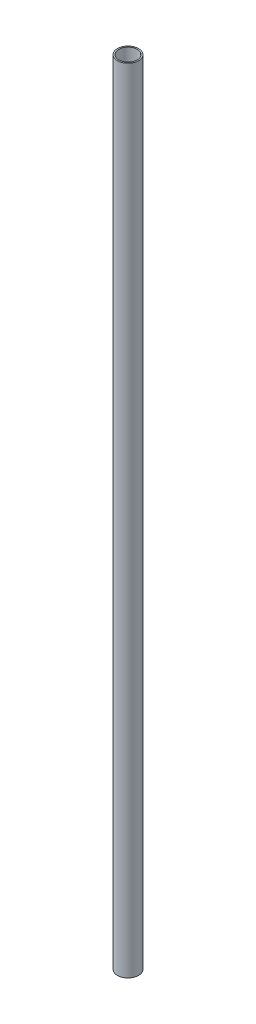
ISO-10303-21;
HEADER;
FILE_DESCRIPTION(('STEP AP214'),'2;1');
FILE_NAME('part.step','',(''),(''),'','','');
FILE_SCHEMA(('AUTOMOTIVE_DESIGN { 1 0 10303 214 1 1 1 1 }'));
ENDSEC;
DATA;
#1=APPLICATION_CONTEXT('core data for automotive mechanical design processes');
#2=APPLICATION_PROTOCOL_DEFINITION('international standard','automotive_design',2000,#1);
#3=PRODUCT_CONTEXT('',#1,'mechanical');
#4=PRODUCT('Part','Part','',(#3));
#5=PRODUCT_RELATED_PRODUCT_CATEGORY('part','',(#4));
#6=PRODUCT_DEFINITION_FORMATION('','',#4);
#7=PRODUCT_DEFINITION_CONTEXT('part definition',#1,'design');
#8=PRODUCT_DEFINITION('design','',#6,#7);
#9=PRODUCT_DEFINITION_SHAPE('','',#8);
#10=(LENGTH_UNIT() NAMED_UNIT(*) SI_UNIT(.MILLI.,.METRE.));
#11=(NAMED_UNIT(*) PLANE_ANGLE_UNIT() SI_UNIT($,.RADIAN.));
#12=(NAMED_UNIT(*) SI_UNIT($,.STERADIAN.) SOLID_ANGLE_UNIT());
#13=UNCERTAINTY_MEASURE_WITH_UNIT(LENGTH_MEASURE(1.E-05),#10,'distance_accuracy_value','');
#14=(GEOMETRIC_REPRESENTATION_CONTEXT(3) GLOBAL_UNCERTAINTY_ASSIGNED_CONTEXT((#13)) GLOBAL_UNIT_ASSIGNED_CONTEXT((#10,
#11,#12)) REPRESENTATION_CONTEXT('',''));
#15=CARTESIAN_POINT('',(0.,0.,0.));
#16=DIRECTION('',(0.,0.,1.));
#17=DIRECTION('',(1.,0.,0.));
#18=AXIS2_PLACEMENT_3D('',#15,#16,#17);
#19=CARTESIAN_POINT('',(0.,300.,0.));
#20=DIRECTION('',(0.,1.,0.));
#21=DIRECTION('',(0.,0.,1.));
#22=AXIS2_PLACEMENT_3D('',#19,#20,#21);
#23=PLANE('',#22);
#24=CARTESIAN_POINT('',(0.,300.,0.));
#25=DIRECTION('',(0.,1.,0.));
#26=DIRECTION('',(0.,0.,1.));
#27=AXIS2_PLACEMENT_3D('',#24,#25,#26);
#28=CIRCLE('',#27,4.);
#29=CARTESIAN_POINT('',(0.,300.,4.));
#30=VERTEX_POINT('',#29);
#31=EDGE_CURVE('E10',#30,#30,#28,.T.);
#32=ORIENTED_EDGE('',*,*,#31,.T.);
#33=EDGE_LOOP('',(#32));
#34=FACE_BOUND('',#33,.T.);
#35=CARTESIAN_POINT('',(0.,300.,0.));
#36=DIRECTION('',(0.,1.,0.));
#37=DIRECTION('',(0.,0.,1.));
#38=AXIS2_PLACEMENT_3D('',#35,#36,#37);
#39=CIRCLE('',#38,3.5);
#40=CARTESIAN_POINT('',(0.,300.,3.5));
#41=VERTEX_POINT('',#40);
#42=EDGE_CURVE('E46',#41,#41,#39,.T.);
#43=ORIENTED_EDGE('',*,*,#42,.F.);
#44=EDGE_LOOP('',(#43));
#45=FACE_BOUND('',#44,.T.);
#46=ADVANCED_FACE('F35',(#34,#45),#23,.T.);
#47=CARTESIAN_POINT('',(0.,0.,0.));
#48=DIRECTION('',(0.,1.,0.));
#49=DIRECTION('',(0.,0.,1.));
#50=AXIS2_PLACEMENT_3D('',#47,#48,#49);
#51=PLANE('',#50);
#52=CARTESIAN_POINT('',(0.,0.,0.));
#53=DIRECTION('',(0.,1.,0.));
#54=DIRECTION('',(0.,0.,1.));
#55=AXIS2_PLACEMENT_3D('',#52,#53,#54);
#56=CIRCLE('',#55,4.);
#57=CARTESIAN_POINT('',(0.,0.,4.));
#58=VERTEX_POINT('',#57);
#59=EDGE_CURVE('E39',#58,#58,#56,.T.);
#60=ORIENTED_EDGE('',*,*,#59,.F.);
#61=EDGE_LOOP('',(#60));
#62=FACE_BOUND('',#61,.T.);
#63=CARTESIAN_POINT('',(0.,0.,0.));
#64=DIRECTION('',(0.,1.,0.));
#65=DIRECTION('',(0.,0.,1.));
#66=AXIS2_PLACEMENT_3D('',#63,#64,#65);
#67=CIRCLE('',#66,3.5);
#68=CARTESIAN_POINT('',(0.,0.,3.5));
#69=VERTEX_POINT('',#68);
#70=EDGE_CURVE('E48',#69,#69,#67,.T.);
#71=ORIENTED_EDGE('',*,*,#70,.T.);
#72=EDGE_LOOP('',(#71));
#73=FACE_BOUND('',#72,.T.);
#74=ADVANCED_FACE('F58',(#62,#73),#51,.F.);
#75=CARTESIAN_POINT('',(0.,300.,0.));
#76=DIRECTION('',(0.,-1.,0.));
#77=DIRECTION('',(0.,0.,-1.));
#78=AXIS2_PLACEMENT_3D('',#75,#76,#77);
#79=CYLINDRICAL_SURFACE('',#78,4.);
#80=ORIENTED_EDGE('',*,*,#31,.F.);
#81=EDGE_LOOP('',(#80));
#82=FACE_BOUND('',#81,.T.);
#83=ORIENTED_EDGE('',*,*,#59,.T.);
#84=EDGE_LOOP('',(#83));
#85=FACE_BOUND('',#84,.T.);
#86=ADVANCED_FACE('F37',(#82,#85),#79,.T.);
#87=CARTESIAN_POINT('',(0.,300.,0.));
#88=DIRECTION('',(0.,-1.,0.));
#89=DIRECTION('',(0.,0.,-1.));
#90=AXIS2_PLACEMENT_3D('',#87,#88,#89);
#91=CYLINDRICAL_SURFACE('',#90,3.5);
#92=ORIENTED_EDGE('',*,*,#42,.T.);
#93=EDGE_LOOP('',(#92));
#94=FACE_BOUND('',#93,.T.);
#95=ORIENTED_EDGE('',*,*,#70,.F.);
#96=EDGE_LOOP('',(#95));
#97=FACE_BOUND('',#96,.T.);
#98=ADVANCED_FACE('F54',(#94,#97),#91,.F.);
#99=CLOSED_SHELL('',(#46,#74,#86,#98));
#100=MANIFOLD_SOLID_BREP('B2',#99);
#101=ADVANCED_BREP_SHAPE_REPRESENTATION('',(#18,#100),#14);
#102=SHAPE_DEFINITION_REPRESENTATION(#9,#101);
ENDSEC;
END-ISO-10303-21;
